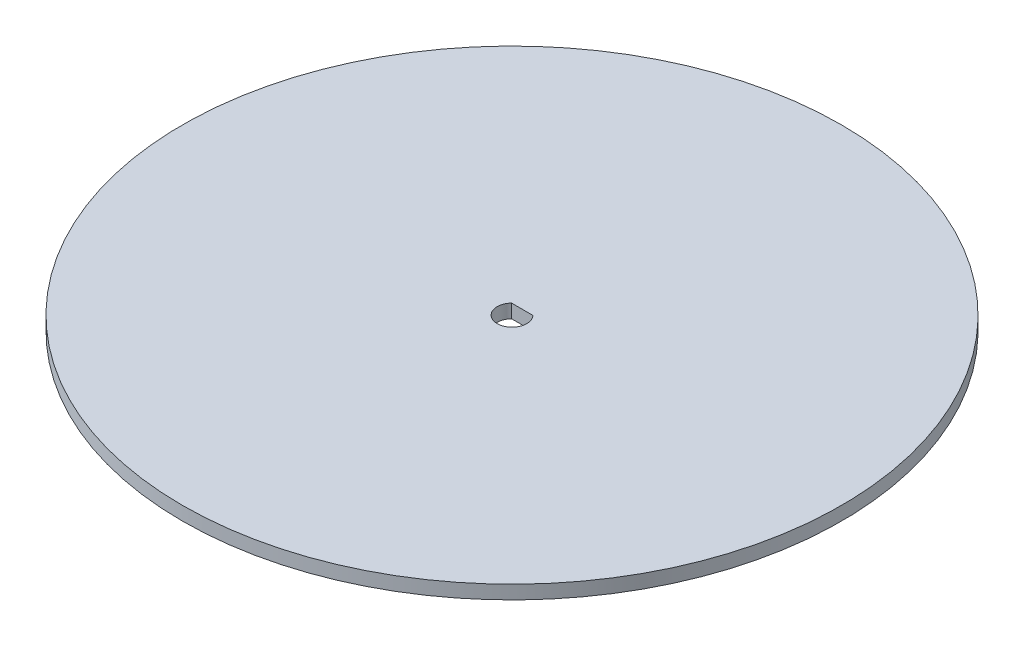
ISO-10303-21;
HEADER;
FILE_DESCRIPTION(('STEP AP214'),'2;1');
FILE_NAME('part.step','',(''),(''),'','','');
FILE_SCHEMA(('AUTOMOTIVE_DESIGN { 1 0 10303 214 1 1 1 1 }'));
ENDSEC;
DATA;
#1=APPLICATION_CONTEXT('core data for automotive mechanical design processes');
#2=APPLICATION_PROTOCOL_DEFINITION('international standard','automotive_design',2000,#1);
#3=PRODUCT_CONTEXT('',#1,'mechanical');
#4=PRODUCT('Part','Part','',(#3));
#5=PRODUCT_RELATED_PRODUCT_CATEGORY('part','',(#4));
#6=PRODUCT_DEFINITION_FORMATION('','',#4);
#7=PRODUCT_DEFINITION_CONTEXT('part definition',#1,'design');
#8=PRODUCT_DEFINITION('design','',#6,#7);
#9=PRODUCT_DEFINITION_SHAPE('','',#8);
#10=(LENGTH_UNIT() NAMED_UNIT(*) SI_UNIT(.MILLI.,.METRE.));
#11=(NAMED_UNIT(*) PLANE_ANGLE_UNIT() SI_UNIT($,.RADIAN.));
#12=(NAMED_UNIT(*) SI_UNIT($,.STERADIAN.) SOLID_ANGLE_UNIT());
#13=UNCERTAINTY_MEASURE_WITH_UNIT(LENGTH_MEASURE(1.E-05),#10,'distance_accuracy_value','');
#14=(GEOMETRIC_REPRESENTATION_CONTEXT(3) GLOBAL_UNCERTAINTY_ASSIGNED_CONTEXT((#13)) GLOBAL_UNIT_ASSIGNED_CONTEXT((#10,
#11,#12)) REPRESENTATION_CONTEXT('',''));
#15=CARTESIAN_POINT('',(0.,0.,0.));
#16=DIRECTION('',(0.,0.,1.));
#17=DIRECTION('',(1.,0.,0.));
#18=AXIS2_PLACEMENT_3D('',#15,#16,#17);
#19=CARTESIAN_POINT('',(0.,-3.,0.));
#20=DIRECTION('',(0.,1.,0.));
#21=DIRECTION('',(0.,0.,1.));
#22=AXIS2_PLACEMENT_3D('',#19,#20,#21);
#23=CYLINDRICAL_SURFACE('',#22,72.5);
#24=CARTESIAN_POINT('',(0.,-3.,0.));
#25=DIRECTION('',(0.,1.,0.));
#26=DIRECTION('',(0.,0.,1.));
#27=AXIS2_PLACEMENT_3D('',#24,#25,#26);
#28=CIRCLE('',#27,72.5);
#29=CARTESIAN_POINT('',(0.,-3.,72.5));
#30=VERTEX_POINT('',#29);
#31=EDGE_CURVE('E11',#30,#30,#28,.T.);
#32=ORIENTED_EDGE('',*,*,#31,.T.);
#33=EDGE_LOOP('',(#32));
#34=FACE_BOUND('',#33,.T.);
#35=CARTESIAN_POINT('',(0.,0.,0.));
#36=DIRECTION('',(0.,1.,0.));
#37=DIRECTION('',(0.,0.,1.));
#38=AXIS2_PLACEMENT_3D('',#35,#36,#37);
#39=CIRCLE('',#38,72.5);
#40=CARTESIAN_POINT('',(0.,0.,72.5));
#41=VERTEX_POINT('',#40);
#42=EDGE_CURVE('E43',#41,#41,#39,.T.);
#43=ORIENTED_EDGE('',*,*,#42,.F.);
#44=EDGE_LOOP('',(#43));
#45=FACE_BOUND('',#44,.T.);
#46=ADVANCED_FACE('F40',(#34,#45),#23,.T.);
#47=CARTESIAN_POINT('',(0.,-3.,0.));
#48=DIRECTION('',(0.,1.,0.));
#49=DIRECTION('',(0.,0.,1.));
#50=AXIS2_PLACEMENT_3D('',#47,#48,#49);
#51=PLANE('',#50);
#52=DIRECTION('',(1.,0.,0.));
#53=VECTOR('',#52,1.);
#54=CARTESIAN_POINT('',(-2.34520787991171,-3.,-2.25));
#55=LINE('',#54,#53);
#56=CARTESIAN_POINT('',(-2.34520787991171,-3.,-2.25));
#57=VERTEX_POINT('',#56);
#58=CARTESIAN_POINT('',(2.34520787991171,-3.,-2.25));
#59=VERTEX_POINT('',#58);
#60=EDGE_CURVE('E74',#57,#59,#55,.T.);
#61=ORIENTED_EDGE('',*,*,#60,.F.);
#62=CARTESIAN_POINT('',(0.,-3.,0.));
#63=DIRECTION('',(0.,1.,0.));
#64=DIRECTION('',(0.,0.,1.));
#65=AXIS2_PLACEMENT_3D('',#62,#63,#64);
#66=CIRCLE('',#65,3.25);
#67=EDGE_CURVE('E54',#59,#57,#66,.F.);
#68=ORIENTED_EDGE('',*,*,#67,.F.);
#69=EDGE_LOOP('',(#61,#68));
#70=FACE_BOUND('',#69,.T.);
#71=ORIENTED_EDGE('',*,*,#31,.F.);
#72=EDGE_LOOP('',(#71));
#73=FACE_BOUND('',#72,.T.);
#74=ADVANCED_FACE('F78',(#70,#73),#51,.F.);
#75=CARTESIAN_POINT('',(0.,0.,0.));
#76=DIRECTION('',(0.,1.,0.));
#77=DIRECTION('',(0.,0.,1.));
#78=AXIS2_PLACEMENT_3D('',#75,#76,#77);
#79=PLANE('',#78);
#80=CARTESIAN_POINT('',(0.,0.,0.));
#81=DIRECTION('',(0.,1.,0.));
#82=DIRECTION('',(0.,0.,1.));
#83=AXIS2_PLACEMENT_3D('',#80,#81,#82);
#84=CIRCLE('',#83,3.25);
#85=CARTESIAN_POINT('',(-2.34520787991171,0.,-2.25));
#86=VERTEX_POINT('',#85);
#87=CARTESIAN_POINT('',(2.34520787991171,0.,-2.25));
#88=VERTEX_POINT('',#87);
#89=EDGE_CURVE('E59',#86,#88,#84,.T.);
#90=ORIENTED_EDGE('',*,*,#89,.F.);
#91=DIRECTION('',(-1.,0.,0.));
#92=VECTOR('',#91,1.);
#93=CARTESIAN_POINT('',(-2.34520787991171,0.,-2.25));
#94=LINE('',#93,#92);
#95=EDGE_CURVE('E71',#88,#86,#94,.T.);
#96=ORIENTED_EDGE('',*,*,#95,.F.);
#97=EDGE_LOOP('',(#90,#96));
#98=FACE_BOUND('',#97,.T.);
#99=ORIENTED_EDGE('',*,*,#42,.T.);
#100=EDGE_LOOP('',(#99));
#101=FACE_BOUND('',#100,.T.);
#102=ADVANCED_FACE('F85',(#98,#101),#79,.T.);
#103=CARTESIAN_POINT('',(0.,-3.001,0.));
#104=DIRECTION('',(0.,1.,0.));
#105=DIRECTION('',(0.,0.,1.));
#106=AXIS2_PLACEMENT_3D('',#103,#104,#105);
#107=CYLINDRICAL_SURFACE('',#106,3.25);
#108=ORIENTED_EDGE('',*,*,#67,.T.);
#109=DIRECTION('',(0.,1.,0.));
#110=VECTOR('',#109,1.);
#111=CARTESIAN_POINT('',(-2.34520787991171,-3.001,-2.25));
#112=LINE('',#111,#110);
#113=EDGE_CURVE('E70',#57,#86,#112,.T.);
#114=ORIENTED_EDGE('',*,*,#113,.T.);
#115=ORIENTED_EDGE('',*,*,#89,.T.);
#116=DIRECTION('',(0.,1.,0.));
#117=VECTOR('',#116,1.);
#118=CARTESIAN_POINT('',(2.34520787991171,-3.001,-2.25));
#119=LINE('',#118,#117);
#120=EDGE_CURVE('E64',#59,#88,#119,.T.);
#121=ORIENTED_EDGE('',*,*,#120,.F.);
#122=EDGE_LOOP('',(#108,#114,#115,#121));
#123=FACE_BOUND('',#122,.T.);
#124=ADVANCED_FACE('F66',(#123),#107,.F.);
#125=CARTESIAN_POINT('',(-2.34520787991171,-3.001,-2.25));
#126=DIRECTION('',(0.,0.,-1.));
#127=DIRECTION('',(-1.,0.,0.));
#128=AXIS2_PLACEMENT_3D('',#125,#126,#127);
#129=PLANE('',#128);
#130=ORIENTED_EDGE('',*,*,#60,.T.);
#131=ORIENTED_EDGE('',*,*,#120,.T.);
#132=ORIENTED_EDGE('',*,*,#95,.T.);
#133=ORIENTED_EDGE('',*,*,#113,.F.);
#134=EDGE_LOOP('',(#130,#131,#132,#133));
#135=FACE_BOUND('',#134,.T.);
#136=ADVANCED_FACE('F75',(#135),#129,.F.);
#137=CLOSED_SHELL('',(#46,#74,#102,#124,#136));
#138=MANIFOLD_SOLID_BREP('B2',#137);
#139=ADVANCED_BREP_SHAPE_REPRESENTATION('',(#18,#138),#14);
#140=SHAPE_DEFINITION_REPRESENTATION(#9,#139);
ENDSEC;
END-ISO-10303-21;
